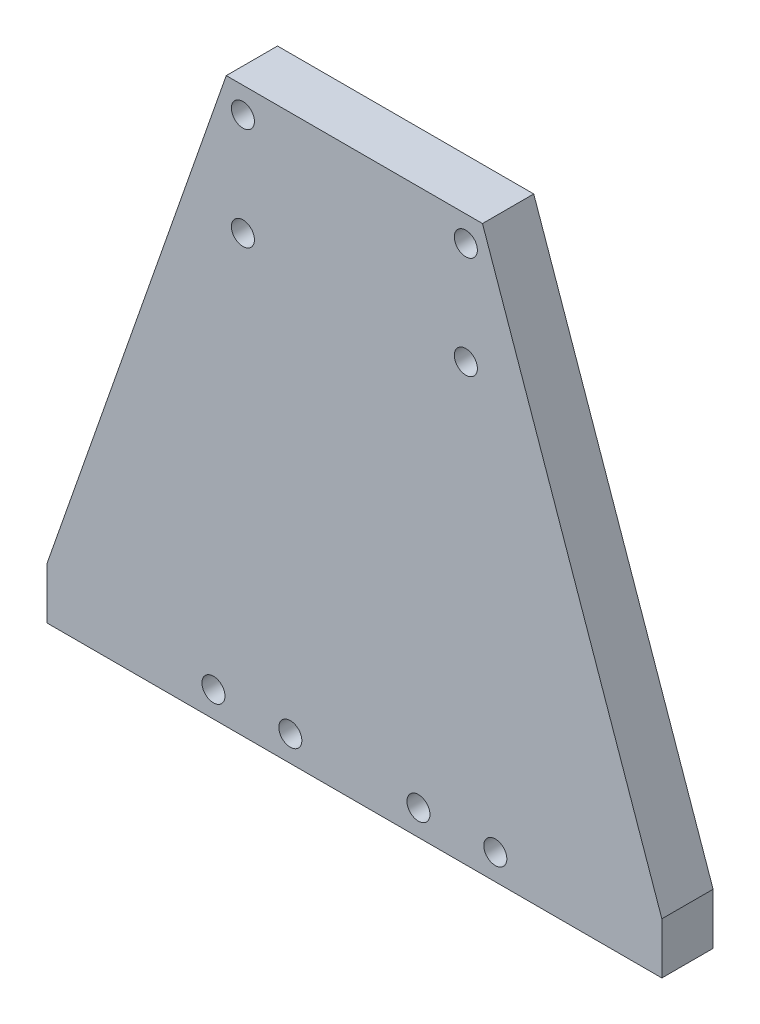
ISO-10303-21;
HEADER;
FILE_DESCRIPTION(('STEP AP214'),'2;1');
FILE_NAME('part.step','',(''),(''),'','','');
FILE_SCHEMA(('AUTOMOTIVE_DESIGN { 1 0 10303 214 1 1 1 1 }'));
ENDSEC;
DATA;
#1=APPLICATION_CONTEXT('core data for automotive mechanical design processes');
#2=APPLICATION_PROTOCOL_DEFINITION('international standard','automotive_design',2000,#1);
#3=PRODUCT_CONTEXT('',#1,'mechanical');
#4=PRODUCT('Part','Part','',(#3));
#5=PRODUCT_RELATED_PRODUCT_CATEGORY('part','',(#4));
#6=PRODUCT_DEFINITION_FORMATION('','',#4);
#7=PRODUCT_DEFINITION_CONTEXT('part definition',#1,'design');
#8=PRODUCT_DEFINITION('design','',#6,#7);
#9=PRODUCT_DEFINITION_SHAPE('','',#8);
#10=(LENGTH_UNIT() NAMED_UNIT(*) SI_UNIT(.MILLI.,.METRE.));
#11=(NAMED_UNIT(*) PLANE_ANGLE_UNIT() SI_UNIT($,.RADIAN.));
#12=(NAMED_UNIT(*) SI_UNIT($,.STERADIAN.) SOLID_ANGLE_UNIT());
#13=UNCERTAINTY_MEASURE_WITH_UNIT(LENGTH_MEASURE(1.E-05),#10,'distance_accuracy_value','');
#14=(GEOMETRIC_REPRESENTATION_CONTEXT(3) GLOBAL_UNCERTAINTY_ASSIGNED_CONTEXT((#13)) GLOBAL_UNIT_ASSIGNED_CONTEXT((#10,
#11,#12)) REPRESENTATION_CONTEXT('',''));
#15=CARTESIAN_POINT('',(0.,0.,0.));
#16=DIRECTION('',(0.,0.,1.));
#17=DIRECTION('',(1.,0.,0.));
#18=AXIS2_PLACEMENT_3D('',#15,#16,#17);
#19=CARTESIAN_POINT('',(0.,0.,10.));
#20=DIRECTION('',(0.,0.,-1.));
#21=DIRECTION('',(-1.,0.,0.));
#22=AXIS2_PLACEMENT_3D('',#19,#20,#21);
#23=PLANE('',#22);
#24=CARTESIAN_POINT('',(-21.75,100.,10.));
#25=DIRECTION('',(0.,0.,1.));
#26=DIRECTION('',(1.,0.,0.));
#27=AXIS2_PLACEMENT_3D('',#24,#25,#26);
#28=CIRCLE('',#27,2.25);
#29=CARTESIAN_POINT('',(-19.5,100.,10.));
#30=VERTEX_POINT('',#29);
#31=EDGE_CURVE('E216',#30,#30,#28,.T.);
#32=ORIENTED_EDGE('',*,*,#31,.F.);
#33=EDGE_LOOP('',(#32));
#34=FACE_BOUND('',#33,.T.);
#35=CARTESIAN_POINT('',(-21.75,80.,10.));
#36=DIRECTION('',(0.,0.,1.));
#37=DIRECTION('',(1.,0.,0.));
#38=AXIS2_PLACEMENT_3D('',#35,#36,#37);
#39=CIRCLE('',#38,2.25);
#40=CARTESIAN_POINT('',(-19.5,80.,10.));
#41=VERTEX_POINT('',#40);
#42=EDGE_CURVE('E205',#41,#41,#39,.T.);
#43=ORIENTED_EDGE('',*,*,#42,.F.);
#44=EDGE_LOOP('',(#43));
#45=FACE_BOUND('',#44,.T.);
#46=DIRECTION('',(-0.330350424728106,0.943858356366017,0.));
#47=VECTOR('',#46,1.);
#48=CARTESIAN_POINT('',(60.,5.,10.));
#49=LINE('',#48,#47);
#50=CARTESIAN_POINT('',(60.,5.,10.));
#51=VERTEX_POINT('',#50);
#52=CARTESIAN_POINT('',(25.,105.,10.));
#53=VERTEX_POINT('',#52);
#54=EDGE_CURVE('E129',#51,#53,#49,.T.);
#55=ORIENTED_EDGE('',*,*,#54,.T.);
#56=DIRECTION('',(-1.,0.,0.));
#57=VECTOR('',#56,1.);
#58=CARTESIAN_POINT('',(-25.,105.,10.));
#59=LINE('',#58,#57);
#60=CARTESIAN_POINT('',(-25.,105.,10.));
#61=VERTEX_POINT('',#60);
#62=EDGE_CURVE('E87',#53,#61,#59,.T.);
#63=ORIENTED_EDGE('',*,*,#62,.T.);
#64=DIRECTION('',(-0.330350424728106,-0.943858356366018,0.));
#65=VECTOR('',#64,1.);
#66=CARTESIAN_POINT('',(-60.,5.,10.));
#67=LINE('',#66,#65);
#68=CARTESIAN_POINT('',(-60.,5.,10.));
#69=VERTEX_POINT('',#68);
#70=EDGE_CURVE('E100',#61,#69,#67,.T.);
#71=ORIENTED_EDGE('',*,*,#70,.T.);
#72=DIRECTION('',(0.,-1.,0.));
#73=VECTOR('',#72,1.);
#74=CARTESIAN_POINT('',(-60.,-5.,10.));
#75=LINE('',#74,#73);
#76=CARTESIAN_POINT('',(-60.,-5.,10.));
#77=VERTEX_POINT('',#76);
#78=EDGE_CURVE('E94',#69,#77,#75,.T.);
#79=ORIENTED_EDGE('',*,*,#78,.T.);
#80=DIRECTION('',(1.,0.,0.));
#81=VECTOR('',#80,1.);
#82=CARTESIAN_POINT('',(-60.,-5.,10.));
#83=LINE('',#82,#81);
#84=CARTESIAN_POINT('',(60.,-5.,10.));
#85=VERTEX_POINT('',#84);
#86=EDGE_CURVE('E98',#77,#85,#83,.T.);
#87=ORIENTED_EDGE('',*,*,#86,.T.);
#88=DIRECTION('',(0.,1.,0.));
#89=VECTOR('',#88,1.);
#90=CARTESIAN_POINT('',(60.,-5.,10.));
#91=LINE('',#90,#89);
#92=EDGE_CURVE('E50',#85,#51,#91,.T.);
#93=ORIENTED_EDGE('',*,*,#92,.T.);
#94=EDGE_LOOP('',(#55,#63,#71,#79,#87,#93));
#95=FACE_BOUND('',#94,.T.);
#96=CARTESIAN_POINT('',(27.5,0.,10.));
#97=DIRECTION('',(0.,0.,1.));
#98=DIRECTION('',(1.,0.,0.));
#99=AXIS2_PLACEMENT_3D('',#96,#97,#98);
#100=CIRCLE('',#99,2.25);
#101=CARTESIAN_POINT('',(29.75,0.,10.));
#102=VERTEX_POINT('',#101);
#103=EDGE_CURVE('E122',#102,#102,#100,.T.);
#104=ORIENTED_EDGE('',*,*,#103,.F.);
#105=EDGE_LOOP('',(#104));
#106=FACE_BOUND('',#105,.T.);
#107=CARTESIAN_POINT('',(12.5,0.,10.));
#108=DIRECTION('',(0.,0.,1.));
#109=DIRECTION('',(1.,0.,0.));
#110=AXIS2_PLACEMENT_3D('',#107,#108,#109);
#111=CIRCLE('',#110,2.25);
#112=CARTESIAN_POINT('',(14.75,0.,10.));
#113=VERTEX_POINT('',#112);
#114=EDGE_CURVE('E237',#113,#113,#111,.T.);
#115=ORIENTED_EDGE('',*,*,#114,.F.);
#116=EDGE_LOOP('',(#115));
#117=FACE_BOUND('',#116,.T.);
#118=CARTESIAN_POINT('',(-12.5,0.,10.));
#119=DIRECTION('',(0.,0.,1.));
#120=DIRECTION('',(1.,0.,0.));
#121=AXIS2_PLACEMENT_3D('',#118,#119,#120);
#122=CIRCLE('',#121,2.25);
#123=CARTESIAN_POINT('',(-10.25,0.,10.));
#124=VERTEX_POINT('',#123);
#125=EDGE_CURVE('E231',#124,#124,#122,.T.);
#126=ORIENTED_EDGE('',*,*,#125,.F.);
#127=EDGE_LOOP('',(#126));
#128=FACE_BOUND('',#127,.T.);
#129=CARTESIAN_POINT('',(-27.5,0.,10.));
#130=DIRECTION('',(0.,0.,1.));
#131=DIRECTION('',(1.,0.,0.));
#132=AXIS2_PLACEMENT_3D('',#129,#130,#131);
#133=CIRCLE('',#132,2.25);
#134=CARTESIAN_POINT('',(-25.25,0.,10.));
#135=VERTEX_POINT('',#134);
#136=EDGE_CURVE('E225',#135,#135,#133,.T.);
#137=ORIENTED_EDGE('',*,*,#136,.F.);
#138=EDGE_LOOP('',(#137));
#139=FACE_BOUND('',#138,.T.);
#140=CARTESIAN_POINT('',(21.75,80.,10.));
#141=DIRECTION('',(0.,0.,1.));
#142=DIRECTION('',(1.,0.,0.));
#143=AXIS2_PLACEMENT_3D('',#140,#141,#142);
#144=CIRCLE('',#143,2.25);
#145=CARTESIAN_POINT('',(24.,80.,10.));
#146=VERTEX_POINT('',#145);
#147=EDGE_CURVE('E201',#146,#146,#144,.F.);
#148=ORIENTED_EDGE('',*,*,#147,.T.);
#149=EDGE_LOOP('',(#148));
#150=FACE_BOUND('',#149,.T.);
#151=CARTESIAN_POINT('',(21.75,100.,10.));
#152=DIRECTION('',(0.,0.,1.));
#153=DIRECTION('',(1.,0.,0.));
#154=AXIS2_PLACEMENT_3D('',#151,#152,#153);
#155=CIRCLE('',#154,2.25);
#156=CARTESIAN_POINT('',(24.,100.,10.));
#157=VERTEX_POINT('',#156);
#158=EDGE_CURVE('E208',#157,#157,#155,.F.);
#159=ORIENTED_EDGE('',*,*,#158,.T.);
#160=EDGE_LOOP('',(#159));
#161=FACE_BOUND('',#160,.T.);
#162=ADVANCED_FACE('F33',(#34,#45,#95,#106,#117,#128,#139,#150,#161),#23,.F.);
#163=CARTESIAN_POINT('',(0.,0.,0.));
#164=DIRECTION('',(0.,0.,-1.));
#165=DIRECTION('',(-1.,0.,0.));
#166=AXIS2_PLACEMENT_3D('',#163,#164,#165);
#167=PLANE('',#166);
#168=CARTESIAN_POINT('',(-21.75,100.,0.));
#169=DIRECTION('',(0.,0.,1.));
#170=DIRECTION('',(1.,0.,0.));
#171=AXIS2_PLACEMENT_3D('',#168,#169,#170);
#172=CIRCLE('',#171,2.25);
#173=CARTESIAN_POINT('',(-19.5,100.,0.));
#174=VERTEX_POINT('',#173);
#175=EDGE_CURVE('E213',#174,#174,#172,.T.);
#176=ORIENTED_EDGE('',*,*,#175,.T.);
#177=EDGE_LOOP('',(#176));
#178=FACE_BOUND('',#177,.T.);
#179=CARTESIAN_POINT('',(21.75,80.,0.));
#180=DIRECTION('',(0.,0.,1.));
#181=DIRECTION('',(1.,0.,0.));
#182=AXIS2_PLACEMENT_3D('',#179,#180,#181);
#183=CIRCLE('',#182,2.25);
#184=CARTESIAN_POINT('',(24.,80.,0.));
#185=VERTEX_POINT('',#184);
#186=EDGE_CURVE('E198',#185,#185,#183,.F.);
#187=ORIENTED_EDGE('',*,*,#186,.F.);
#188=EDGE_LOOP('',(#187));
#189=FACE_BOUND('',#188,.T.);
#190=CARTESIAN_POINT('',(-21.75,80.,0.));
#191=DIRECTION('',(0.,0.,1.));
#192=DIRECTION('',(1.,0.,0.));
#193=AXIS2_PLACEMENT_3D('',#190,#191,#192);
#194=CIRCLE('',#193,2.25);
#195=CARTESIAN_POINT('',(-19.5,80.,0.));
#196=VERTEX_POINT('',#195);
#197=EDGE_CURVE('E219',#196,#196,#194,.T.);
#198=ORIENTED_EDGE('',*,*,#197,.T.);
#199=EDGE_LOOP('',(#198));
#200=FACE_BOUND('',#199,.T.);
#201=CARTESIAN_POINT('',(-12.5,0.,0.));
#202=DIRECTION('',(0.,0.,1.));
#203=DIRECTION('',(1.,0.,0.));
#204=AXIS2_PLACEMENT_3D('',#201,#202,#203);
#205=CIRCLE('',#204,2.25);
#206=CARTESIAN_POINT('',(-10.25,0.,0.));
#207=VERTEX_POINT('',#206);
#208=EDGE_CURVE('E228',#207,#207,#205,.T.);
#209=ORIENTED_EDGE('',*,*,#208,.T.);
#210=EDGE_LOOP('',(#209));
#211=FACE_BOUND('',#210,.T.);
#212=CARTESIAN_POINT('',(27.5,0.,0.));
#213=DIRECTION('',(0.,0.,1.));
#214=DIRECTION('',(1.,0.,0.));
#215=AXIS2_PLACEMENT_3D('',#212,#213,#214);
#216=CIRCLE('',#215,2.25);
#217=CARTESIAN_POINT('',(29.75,0.,0.));
#218=VERTEX_POINT('',#217);
#219=EDGE_CURVE('E240',#218,#218,#216,.T.);
#220=ORIENTED_EDGE('',*,*,#219,.T.);
#221=EDGE_LOOP('',(#220));
#222=FACE_BOUND('',#221,.T.);
#223=DIRECTION('',(-0.330350424728106,0.943858356366017,0.));
#224=VECTOR('',#223,1.);
#225=CARTESIAN_POINT('',(60.,5.,0.));
#226=LINE('',#225,#224);
#227=CARTESIAN_POINT('',(60.,5.,0.));
#228=VERTEX_POINT('',#227);
#229=CARTESIAN_POINT('',(25.,105.,0.));
#230=VERTEX_POINT('',#229);
#231=EDGE_CURVE('E118',#228,#230,#226,.T.);
#232=ORIENTED_EDGE('',*,*,#231,.F.);
#233=DIRECTION('',(0.,1.,0.));
#234=VECTOR('',#233,1.);
#235=CARTESIAN_POINT('',(60.,-5.,0.));
#236=LINE('',#235,#234);
#237=CARTESIAN_POINT('',(60.,-5.,0.));
#238=VERTEX_POINT('',#237);
#239=EDGE_CURVE('E79',#238,#228,#236,.T.);
#240=ORIENTED_EDGE('',*,*,#239,.F.);
#241=DIRECTION('',(1.,0.,0.));
#242=VECTOR('',#241,1.);
#243=CARTESIAN_POINT('',(-60.,-5.,0.));
#244=LINE('',#243,#242);
#245=CARTESIAN_POINT('',(-60.,-5.,0.));
#246=VERTEX_POINT('',#245);
#247=EDGE_CURVE('E73',#246,#238,#244,.T.);
#248=ORIENTED_EDGE('',*,*,#247,.F.);
#249=DIRECTION('',(0.,-1.,0.));
#250=VECTOR('',#249,1.);
#251=CARTESIAN_POINT('',(-60.,-5.,0.));
#252=LINE('',#251,#250);
#253=CARTESIAN_POINT('',(-60.,5.,0.));
#254=VERTEX_POINT('',#253);
#255=EDGE_CURVE('E108',#254,#246,#252,.T.);
#256=ORIENTED_EDGE('',*,*,#255,.F.);
#257=DIRECTION('',(-0.330350424728106,-0.943858356366018,0.));
#258=VECTOR('',#257,1.);
#259=CARTESIAN_POINT('',(-60.,5.,0.));
#260=LINE('',#259,#258);
#261=CARTESIAN_POINT('',(-25.,105.,0.));
#262=VERTEX_POINT('',#261);
#263=EDGE_CURVE('E124',#262,#254,#260,.T.);
#264=ORIENTED_EDGE('',*,*,#263,.F.);
#265=DIRECTION('',(-1.,0.,0.));
#266=VECTOR('',#265,1.);
#267=CARTESIAN_POINT('',(-25.,105.,0.));
#268=LINE('',#267,#266);
#269=EDGE_CURVE('E121',#230,#262,#268,.T.);
#270=ORIENTED_EDGE('',*,*,#269,.F.);
#271=EDGE_LOOP('',(#232,#240,#248,#256,#264,#270));
#272=FACE_BOUND('',#271,.T.);
#273=CARTESIAN_POINT('',(12.5,0.,0.));
#274=DIRECTION('',(0.,0.,1.));
#275=DIRECTION('',(1.,0.,0.));
#276=AXIS2_PLACEMENT_3D('',#273,#274,#275);
#277=CIRCLE('',#276,2.25);
#278=CARTESIAN_POINT('',(14.75,0.,0.));
#279=VERTEX_POINT('',#278);
#280=EDGE_CURVE('E234',#279,#279,#277,.T.);
#281=ORIENTED_EDGE('',*,*,#280,.T.);
#282=EDGE_LOOP('',(#281));
#283=FACE_BOUND('',#282,.T.);
#284=CARTESIAN_POINT('',(-27.5,0.,0.));
#285=DIRECTION('',(0.,0.,1.));
#286=DIRECTION('',(1.,0.,0.));
#287=AXIS2_PLACEMENT_3D('',#284,#285,#286);
#288=CIRCLE('',#287,2.25);
#289=CARTESIAN_POINT('',(-25.25,0.,0.));
#290=VERTEX_POINT('',#289);
#291=EDGE_CURVE('E222',#290,#290,#288,.T.);
#292=ORIENTED_EDGE('',*,*,#291,.T.);
#293=EDGE_LOOP('',(#292));
#294=FACE_BOUND('',#293,.T.);
#295=CARTESIAN_POINT('',(21.75,100.,0.));
#296=DIRECTION('',(0.,0.,1.));
#297=DIRECTION('',(1.,0.,0.));
#298=AXIS2_PLACEMENT_3D('',#295,#296,#297);
#299=CIRCLE('',#298,2.25);
#300=CARTESIAN_POINT('',(24.,100.,0.));
#301=VERTEX_POINT('',#300);
#302=EDGE_CURVE('E203',#301,#301,#299,.F.);
#303=ORIENTED_EDGE('',*,*,#302,.F.);
#304=EDGE_LOOP('',(#303));
#305=FACE_BOUND('',#304,.T.);
#306=ADVANCED_FACE('F138',(#178,#189,#200,#211,#222,#272,#283,#294,#305),#167,.T.);
#307=CARTESIAN_POINT('',(60.,5.,10.));
#308=DIRECTION('',(-0.943858356366017,-0.330350424728106,0.));
#309=DIRECTION('',(0.330350424728106,-0.943858356366017,0.));
#310=AXIS2_PLACEMENT_3D('',#307,#308,#309);
#311=PLANE('',#310);
#312=ORIENTED_EDGE('',*,*,#231,.T.);
#313=DIRECTION('',(0.,0.,-1.));
#314=VECTOR('',#313,1.);
#315=CARTESIAN_POINT('',(25.,105.,10.));
#316=LINE('',#315,#314);
#317=EDGE_CURVE('E11',#53,#230,#316,.T.);
#318=ORIENTED_EDGE('',*,*,#317,.F.);
#319=ORIENTED_EDGE('',*,*,#54,.F.);
#320=DIRECTION('',(0.,0.,-1.));
#321=VECTOR('',#320,1.);
#322=CARTESIAN_POINT('',(60.,5.,10.));
#323=LINE('',#322,#321);
#324=EDGE_CURVE('E114',#51,#228,#323,.T.);
#325=ORIENTED_EDGE('',*,*,#324,.T.);
#326=EDGE_LOOP('',(#312,#318,#319,#325));
#327=FACE_BOUND('',#326,.T.);
#328=ADVANCED_FACE('F35',(#327),#311,.F.);
#329=CARTESIAN_POINT('',(-25.,105.,10.));
#330=DIRECTION('',(0.,-1.,0.));
#331=DIRECTION('',(0.,0.,-1.));
#332=AXIS2_PLACEMENT_3D('',#329,#330,#331);
#333=PLANE('',#332);
#334=ORIENTED_EDGE('',*,*,#269,.T.);
#335=DIRECTION('',(0.,0.,-1.));
#336=VECTOR('',#335,1.);
#337=CARTESIAN_POINT('',(-25.,105.,10.));
#338=LINE('',#337,#336);
#339=EDGE_CURVE('E42',#61,#262,#338,.T.);
#340=ORIENTED_EDGE('',*,*,#339,.F.);
#341=ORIENTED_EDGE('',*,*,#62,.F.);
#342=ORIENTED_EDGE('',*,*,#317,.T.);
#343=EDGE_LOOP('',(#334,#340,#341,#342));
#344=FACE_BOUND('',#343,.T.);
#345=ADVANCED_FACE('F350',(#344),#333,.F.);
#346=CARTESIAN_POINT('',(-60.,5.,10.));
#347=DIRECTION('',(0.943858356366018,-0.330350424728106,0.));
#348=DIRECTION('',(0.330350424728106,0.943858356366018,0.));
#349=AXIS2_PLACEMENT_3D('',#346,#347,#348);
#350=PLANE('',#349);
#351=ORIENTED_EDGE('',*,*,#263,.T.);
#352=DIRECTION('',(0.,0.,-1.));
#353=VECTOR('',#352,1.);
#354=CARTESIAN_POINT('',(-60.,5.,10.));
#355=LINE('',#354,#353);
#356=EDGE_CURVE('E109',#69,#254,#355,.T.);
#357=ORIENTED_EDGE('',*,*,#356,.F.);
#358=ORIENTED_EDGE('',*,*,#70,.F.);
#359=ORIENTED_EDGE('',*,*,#339,.T.);
#360=EDGE_LOOP('',(#351,#357,#358,#359));
#361=FACE_BOUND('',#360,.T.);
#362=ADVANCED_FACE('F135',(#361),#350,.F.);
#363=CARTESIAN_POINT('',(-60.,-5.,10.));
#364=DIRECTION('',(1.,0.,0.));
#365=DIRECTION('',(0.,0.,-1.));
#366=AXIS2_PLACEMENT_3D('',#363,#364,#365);
#367=PLANE('',#366);
#368=ORIENTED_EDGE('',*,*,#255,.T.);
#369=DIRECTION('',(0.,0.,-1.));
#370=VECTOR('',#369,1.);
#371=CARTESIAN_POINT('',(-60.,-5.,10.));
#372=LINE('',#371,#370);
#373=EDGE_CURVE('E105',#77,#246,#372,.T.);
#374=ORIENTED_EDGE('',*,*,#373,.F.);
#375=ORIENTED_EDGE('',*,*,#78,.F.);
#376=ORIENTED_EDGE('',*,*,#356,.T.);
#377=EDGE_LOOP('',(#368,#374,#375,#376));
#378=FACE_BOUND('',#377,.T.);
#379=ADVANCED_FACE('F106',(#378),#367,.F.);
#380=CARTESIAN_POINT('',(-60.,-5.,10.));
#381=DIRECTION('',(0.,1.,0.));
#382=DIRECTION('',(0.,0.,1.));
#383=AXIS2_PLACEMENT_3D('',#380,#381,#382);
#384=PLANE('',#383);
#385=ORIENTED_EDGE('',*,*,#247,.T.);
#386=DIRECTION('',(0.,0.,-1.));
#387=VECTOR('',#386,1.);
#388=CARTESIAN_POINT('',(60.,-5.,10.));
#389=LINE('',#388,#387);
#390=EDGE_CURVE('E110',#85,#238,#389,.T.);
#391=ORIENTED_EDGE('',*,*,#390,.F.);
#392=ORIENTED_EDGE('',*,*,#86,.F.);
#393=ORIENTED_EDGE('',*,*,#373,.T.);
#394=EDGE_LOOP('',(#385,#391,#392,#393));
#395=FACE_BOUND('',#394,.T.);
#396=ADVANCED_FACE('F112',(#395),#384,.F.);
#397=CARTESIAN_POINT('',(60.,-5.,10.));
#398=DIRECTION('',(-1.,0.,0.));
#399=DIRECTION('',(0.,0.,1.));
#400=AXIS2_PLACEMENT_3D('',#397,#398,#399);
#401=PLANE('',#400);
#402=ORIENTED_EDGE('',*,*,#239,.T.);
#403=ORIENTED_EDGE('',*,*,#324,.F.);
#404=ORIENTED_EDGE('',*,*,#92,.F.);
#405=ORIENTED_EDGE('',*,*,#390,.T.);
#406=EDGE_LOOP('',(#402,#403,#404,#405));
#407=FACE_BOUND('',#406,.T.);
#408=ADVANCED_FACE('F143',(#407),#401,.F.);
#409=CARTESIAN_POINT('',(27.5,0.,10.));
#410=DIRECTION('',(0.,0.,-1.));
#411=DIRECTION('',(-1.,0.,0.));
#412=AXIS2_PLACEMENT_3D('',#409,#410,#411);
#413=CYLINDRICAL_SURFACE('',#412,2.25);
#414=ORIENTED_EDGE('',*,*,#103,.T.);
#415=EDGE_LOOP('',(#414));
#416=FACE_BOUND('',#415,.T.);
#417=ORIENTED_EDGE('',*,*,#219,.F.);
#418=EDGE_LOOP('',(#417));
#419=FACE_BOUND('',#418,.T.);
#420=ADVANCED_FACE('F145',(#416,#419),#413,.F.);
#421=CARTESIAN_POINT('',(12.5,0.,10.));
#422=DIRECTION('',(0.,0.,-1.));
#423=DIRECTION('',(-1.,0.,0.));
#424=AXIS2_PLACEMENT_3D('',#421,#422,#423);
#425=CYLINDRICAL_SURFACE('',#424,2.25);
#426=ORIENTED_EDGE('',*,*,#114,.T.);
#427=EDGE_LOOP('',(#426));
#428=FACE_BOUND('',#427,.T.);
#429=ORIENTED_EDGE('',*,*,#280,.F.);
#430=EDGE_LOOP('',(#429));
#431=FACE_BOUND('',#430,.T.);
#432=ADVANCED_FACE('F151',(#428,#431),#425,.F.);
#433=CARTESIAN_POINT('',(-12.5,0.,10.));
#434=DIRECTION('',(0.,0.,-1.));
#435=DIRECTION('',(-1.,0.,0.));
#436=AXIS2_PLACEMENT_3D('',#433,#434,#435);
#437=CYLINDRICAL_SURFACE('',#436,2.25);
#438=ORIENTED_EDGE('',*,*,#125,.T.);
#439=EDGE_LOOP('',(#438));
#440=FACE_BOUND('',#439,.T.);
#441=ORIENTED_EDGE('',*,*,#208,.F.);
#442=EDGE_LOOP('',(#441));
#443=FACE_BOUND('',#442,.T.);
#444=ADVANCED_FACE('F169',(#440,#443),#437,.F.);
#445=CARTESIAN_POINT('',(-27.5,0.,10.));
#446=DIRECTION('',(0.,0.,-1.));
#447=DIRECTION('',(-1.,0.,0.));
#448=AXIS2_PLACEMENT_3D('',#445,#446,#447);
#449=CYLINDRICAL_SURFACE('',#448,2.25);
#450=ORIENTED_EDGE('',*,*,#136,.T.);
#451=EDGE_LOOP('',(#450));
#452=FACE_BOUND('',#451,.T.);
#453=ORIENTED_EDGE('',*,*,#291,.F.);
#454=EDGE_LOOP('',(#453));
#455=FACE_BOUND('',#454,.T.);
#456=ADVANCED_FACE('F173',(#452,#455),#449,.F.);
#457=CARTESIAN_POINT('',(-21.75,80.,0.));
#458=DIRECTION('',(0.,0.,1.));
#459=DIRECTION('',(1.,0.,0.));
#460=AXIS2_PLACEMENT_3D('',#457,#458,#459);
#461=CYLINDRICAL_SURFACE('',#460,2.25);
#462=ORIENTED_EDGE('',*,*,#197,.F.);
#463=EDGE_LOOP('',(#462));
#464=FACE_BOUND('',#463,.T.);
#465=ORIENTED_EDGE('',*,*,#42,.T.);
#466=EDGE_LOOP('',(#465));
#467=FACE_BOUND('',#466,.T.);
#468=ADVANCED_FACE('F177',(#464,#467),#461,.F.);
#469=CARTESIAN_POINT('',(21.75,80.,0.));
#470=DIRECTION('',(0.,0.,1.));
#471=DIRECTION('',(1.,0.,0.));
#472=AXIS2_PLACEMENT_3D('',#469,#470,#471);
#473=CYLINDRICAL_SURFACE('',#472,2.25);
#474=ORIENTED_EDGE('',*,*,#186,.T.);
#475=EDGE_LOOP('',(#474));
#476=FACE_BOUND('',#475,.T.);
#477=ORIENTED_EDGE('',*,*,#147,.F.);
#478=EDGE_LOOP('',(#477));
#479=FACE_BOUND('',#478,.T.);
#480=ADVANCED_FACE('F181',(#476,#479),#473,.F.);
#481=CARTESIAN_POINT('',(21.75,100.,0.));
#482=DIRECTION('',(0.,0.,1.));
#483=DIRECTION('',(1.,0.,0.));
#484=AXIS2_PLACEMENT_3D('',#481,#482,#483);
#485=CYLINDRICAL_SURFACE('',#484,2.25);
#486=ORIENTED_EDGE('',*,*,#302,.T.);
#487=EDGE_LOOP('',(#486));
#488=FACE_BOUND('',#487,.T.);
#489=ORIENTED_EDGE('',*,*,#158,.F.);
#490=EDGE_LOOP('',(#489));
#491=FACE_BOUND('',#490,.T.);
#492=ADVANCED_FACE('F186',(#488,#491),#485,.F.);
#493=CARTESIAN_POINT('',(-21.75,100.,0.));
#494=DIRECTION('',(0.,0.,1.));
#495=DIRECTION('',(1.,0.,0.));
#496=AXIS2_PLACEMENT_3D('',#493,#494,#495);
#497=CYLINDRICAL_SURFACE('',#496,2.25);
#498=ORIENTED_EDGE('',*,*,#175,.F.);
#499=EDGE_LOOP('',(#498));
#500=FACE_BOUND('',#499,.T.);
#501=ORIENTED_EDGE('',*,*,#31,.T.);
#502=EDGE_LOOP('',(#501));
#503=FACE_BOUND('',#502,.T.);
#504=ADVANCED_FACE('F183',(#500,#503),#497,.F.);
#505=CLOSED_SHELL('',(#162,#306,#328,#345,#362,#379,#396,#408,#420,#432,#444,#456,#468,#480,
#492,#504));
#506=MANIFOLD_SOLID_BREP('B2',#505);
#507=ADVANCED_BREP_SHAPE_REPRESENTATION('',(#18,#506),#14);
#508=SHAPE_DEFINITION_REPRESENTATION(#9,#507);
ENDSEC;
END-ISO-10303-21;
